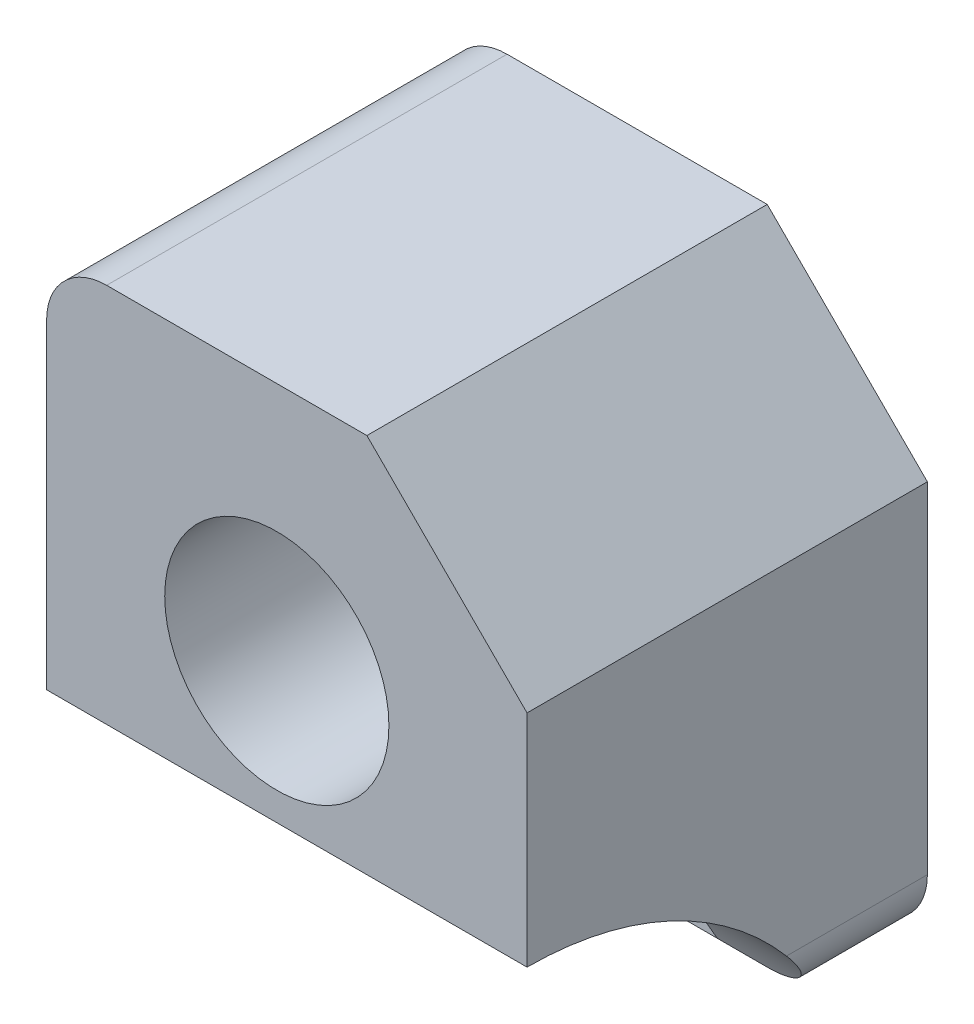
ISO-10303-21;
HEADER;
FILE_DESCRIPTION(('STEP AP214'),'2;1');
FILE_NAME('part.step','',(''),(''),'','','');
FILE_SCHEMA(('AUTOMOTIVE_DESIGN { 1 0 10303 214 1 1 1 1 }'));
ENDSEC;
DATA;
#1=APPLICATION_CONTEXT('core data for automotive mechanical design processes');
#2=APPLICATION_PROTOCOL_DEFINITION('international standard','automotive_design',2000,#1);
#3=PRODUCT_CONTEXT('',#1,'mechanical');
#4=PRODUCT('Part','Part','',(#3));
#5=PRODUCT_RELATED_PRODUCT_CATEGORY('part','',(#4));
#6=PRODUCT_DEFINITION_FORMATION('','',#4);
#7=PRODUCT_DEFINITION_CONTEXT('part definition',#1,'design');
#8=PRODUCT_DEFINITION('design','',#6,#7);
#9=PRODUCT_DEFINITION_SHAPE('','',#8);
#10=(LENGTH_UNIT() NAMED_UNIT(*) SI_UNIT(.MILLI.,.METRE.));
#11=(NAMED_UNIT(*) PLANE_ANGLE_UNIT() SI_UNIT($,.RADIAN.));
#12=(NAMED_UNIT(*) SI_UNIT($,.STERADIAN.) SOLID_ANGLE_UNIT());
#13=UNCERTAINTY_MEASURE_WITH_UNIT(LENGTH_MEASURE(1.E-05),#10,'distance_accuracy_value','');
#14=(GEOMETRIC_REPRESENTATION_CONTEXT(3) GLOBAL_UNCERTAINTY_ASSIGNED_CONTEXT((#13)) GLOBAL_UNIT_ASSIGNED_CONTEXT((#10,
#11,#12)) REPRESENTATION_CONTEXT('',''));
#15=CARTESIAN_POINT('',(0.,0.,0.));
#16=DIRECTION('',(0.,0.,1.));
#17=DIRECTION('',(1.,0.,0.));
#18=AXIS2_PLACEMENT_3D('',#15,#16,#17);
#19=CARTESIAN_POINT('',(14.,4.,20.));
#20=DIRECTION('',(0.,0.,-1.));
#21=DIRECTION('',(-1.,0.,0.));
#22=AXIS2_PLACEMENT_3D('',#19,#20,#21);
#23=CYLINDRICAL_SURFACE('',#22,2.00000000000001);
#24=CARTESIAN_POINT('',(14.,4.,0.));
#25=DIRECTION('',(0.,0.,1.));
#26=DIRECTION('',(1.,0.,0.));
#27=AXIS2_PLACEMENT_3D('',#24,#25,#26);
#28=CIRCLE('',#27,2.00000000000001);
#29=CARTESIAN_POINT('',(16.,4.,0.));
#30=VERTEX_POINT('',#29);
#31=EDGE_CURVE('E230',#30,#30,#28,.T.);
#32=ORIENTED_EDGE('',*,*,#31,.F.);
#33=EDGE_LOOP('',(#32));
#34=FACE_BOUND('',#33,.T.);
#35=CARTESIAN_POINT('',(14.,4.,5.));
#36=DIRECTION('',(0.,0.,1.));
#37=DIRECTION('',(1.,0.,0.));
#38=AXIS2_PLACEMENT_3D('',#35,#36,#37);
#39=CIRCLE('',#38,2.00000000000001);
#40=CARTESIAN_POINT('',(16.,4.,5.));
#41=VERTEX_POINT('',#40);
#42=EDGE_CURVE('E165',#41,#41,#39,.T.);
#43=ORIENTED_EDGE('',*,*,#42,.T.);
#44=EDGE_LOOP('',(#43));
#45=FACE_BOUND('',#44,.T.);
#46=ADVANCED_FACE('F52',(#34,#45),#23,.F.);
#47=CARTESIAN_POINT('',(4.,4.,20.));
#48=DIRECTION('',(0.,0.,-1.));
#49=DIRECTION('',(-1.,0.,0.));
#50=AXIS2_PLACEMENT_3D('',#47,#48,#49);
#51=CYLINDRICAL_SURFACE('',#50,2.);
#52=CARTESIAN_POINT('',(4.,4.,0.));
#53=DIRECTION('',(0.,0.,1.));
#54=DIRECTION('',(1.,0.,0.));
#55=AXIS2_PLACEMENT_3D('',#52,#53,#54);
#56=CIRCLE('',#55,2.);
#57=CARTESIAN_POINT('',(6.,4.,0.));
#58=VERTEX_POINT('',#57);
#59=EDGE_CURVE('E227',#58,#58,#56,.T.);
#60=ORIENTED_EDGE('',*,*,#59,.F.);
#61=EDGE_LOOP('',(#60));
#62=FACE_BOUND('',#61,.T.);
#63=CARTESIAN_POINT('',(4.,4.,5.));
#64=DIRECTION('',(0.,0.,1.));
#65=DIRECTION('',(1.,0.,0.));
#66=AXIS2_PLACEMENT_3D('',#63,#64,#65);
#67=CIRCLE('',#66,2.);
#68=CARTESIAN_POINT('',(6.,4.,5.));
#69=VERTEX_POINT('',#68);
#70=EDGE_CURVE('E196',#69,#69,#67,.T.);
#71=ORIENTED_EDGE('',*,*,#70,.T.);
#72=EDGE_LOOP('',(#71));
#73=FACE_BOUND('',#72,.T.);
#74=ADVANCED_FACE('F293',(#62,#73),#51,.F.);
#75=CARTESIAN_POINT('',(30.,-8.,20.));
#76=DIRECTION('',(-1.,0.,0.));
#77=DIRECTION('',(0.,0.,1.));
#78=AXIS2_PLACEMENT_3D('',#75,#76,#77);
#79=CYLINDRICAL_SURFACE('',#78,17.);
#80=DIRECTION('',(-1.,0.,0.));
#81=VECTOR('',#80,1.);
#82=CARTESIAN_POINT('',(30.,0.,5.));
#83=LINE('',#82,#81);
#84=CARTESIAN_POINT('',(21.,0.,5.));
#85=VERTEX_POINT('',#84);
#86=CARTESIAN_POINT('',(18.5,0.,5.));
#87=VERTEX_POINT('',#86);
#88=EDGE_CURVE('E203',#85,#87,#83,.T.);
#89=ORIENTED_EDGE('',*,*,#88,.F.);
#90=CARTESIAN_POINT('',(21.,0.,5.));
#91=CARTESIAN_POINT('',(21.0764088854411,-1.20717350892555E-05,4.99999811573288));
#92=CARTESIAN_POINT('',(21.1528122415604,0.00291890408008091,5.00155686392892));
#93=CARTESIAN_POINT('',(21.305033199817,0.0145751360655718,5.00777984418738));
#94=CARTESIAN_POINT('',(21.380850918302,0.0232992097306947,5.01244344247861));
#95=CARTESIAN_POINT('',(21.5311310912768,0.0464150590027096,5.02484167087533));
#96=CARTESIAN_POINT('',(21.605596937509,0.0607897001509363,5.03256701728735));
#97=CARTESIAN_POINT('',(21.752854744433,0.0950158277154609,5.05105038471105));
#98=CARTESIAN_POINT('',(21.8256466791367,0.114867399100566,5.06180845277228));
#99=CARTESIAN_POINT('',(22.040710341514,0.182301746184372,5.09857082495992));
#100=CARTESIAN_POINT('',(22.1798457162863,0.237791763147097,5.12907775409014));
#101=CARTESIAN_POINT('',(22.4459038982596,0.367262546665944,5.2015412051815));
#102=CARTESIAN_POINT('',(22.5728222857226,0.441249970465268,5.24350184985156));
#103=CARTESIAN_POINT('',(22.815731712799,0.607212634009006,5.33966742130828));
#104=CARTESIAN_POINT('',(22.9312401293523,0.699689792304387,5.39422269187068));
#105=CARTESIAN_POINT('',(23.144683707385,0.897260708028354,5.51372799762142));
#106=CARTESIAN_POINT('',(23.2426135343048,1.00235827926834,5.57868117697929));
#107=CARTESIAN_POINT('',(23.429258464551,1.23282793684815,5.72500975226815));
#108=CARTESIAN_POINT('',(23.5159793076029,1.35917302313789,5.80738818726223));
#109=CARTESIAN_POINT('',(23.6671475183482,1.61837824079589,5.98175312170164));
#110=CARTESIAN_POINT('',(23.731578597622,1.75124305589147,6.07374658375145));
#111=CARTESIAN_POINT('',(23.8475988611937,2.04119929945403,6.28100233865607));
#112=CARTESIAN_POINT('',(23.8955026691378,2.19877587214032,6.39763604585119));
#113=CARTESIAN_POINT('',(23.9646098985642,2.51317106338381,6.63914355718186));
#114=CARTESIAN_POINT('',(23.9858288038118,2.66999006884038,6.76401253853305));
#115=CARTESIAN_POINT('',(23.9983146689567,2.88355082731465,6.94035898978488));
#116=CARTESIAN_POINT('',(23.9999991241123,2.94195900161804,6.98925305938526));
#117=CARTESIAN_POINT('',(24.,3.,7.03851860318428));
#118=B_SPLINE_CURVE_WITH_KNOTS('',3,(#90,#91,#92,#93,#94,#95,#96,#97,#98,#99,#100,#101,#102,
#103,#104,#105,#106,#107,#108,#109,#110,#111,#112,#113,#114,#115,#116,#117),.UNSPECIFIED.,.F.,
.F.,(4,2,2,2,2,2,2,2,2,2,2,2,2,4),(0.,0.229145118120811,0.458243476797829,0.686652424242741,
0.915064915411317,1.37136112884847,1.82782180095093,2.29896062787174,2.77024219005592,
3.29016520838336,3.81046736592894,4.41372579560865,5.01663402621998,5.24509986542481),.UNSPECIFIED.);
#119=CARTESIAN_POINT('',(24.,3.,7.03851860318428));
#120=VERTEX_POINT('',#119);
#121=EDGE_CURVE('E60',#85,#120,#118,.T.);
#122=ORIENTED_EDGE('',*,*,#121,.T.);
#123=CARTESIAN_POINT('',(24.,-8.,20.));
#124=DIRECTION('',(-1.,0.,0.));
#125=DIRECTION('',(0.,0.,1.));
#126=AXIS2_PLACEMENT_3D('',#123,#124,#125);
#127=CIRCLE('',#126,17.);
#128=CARTESIAN_POINT('',(24.,9.,20.));
#129=VERTEX_POINT('',#128);
#130=EDGE_CURVE('E205',#129,#120,#127,.T.);
#131=ORIENTED_EDGE('',*,*,#130,.F.);
#132=DIRECTION('',(-1.,0.,0.));
#133=VECTOR('',#132,1.);
#134=CARTESIAN_POINT('',(30.,9.,20.));
#135=LINE('',#134,#133);
#136=CARTESIAN_POINT('',(0.,9.,20.));
#137=VERTEX_POINT('',#136);
#138=EDGE_CURVE('E249',#129,#137,#135,.T.);
#139=ORIENTED_EDGE('',*,*,#138,.T.);
#140=CARTESIAN_POINT('',(0.,-8.,20.));
#141=DIRECTION('',(-1.,0.,0.));
#142=DIRECTION('',(0.,0.,1.));
#143=AXIS2_PLACEMENT_3D('',#140,#141,#142);
#144=CIRCLE('',#143,17.);
#145=CARTESIAN_POINT('',(0.,6.06155281280885,10.4463236137816));
#146=VERTEX_POINT('',#145);
#147=EDGE_CURVE('E200',#137,#146,#144,.T.);
#148=ORIENTED_EDGE('',*,*,#147,.T.);
#149=CARTESIAN_POINT('',(0.,6.06155281280885,10.4463236137816));
#150=CARTESIAN_POINT('',(0.0495576649739206,6.15768125691109,10.5878060626458));
#151=CARTESIAN_POINT('',(0.102114391334273,6.25117350422128,10.7300098451449));
#152=CARTESIAN_POINT('',(0.212865824775228,6.43289213636139,11.0155556706595));
#153=CARTESIAN_POINT('',(0.271059795672405,6.52111920636005,11.1588975628075));
#154=CARTESIAN_POINT('',(0.392808866787494,6.69243783253494,11.4466181049227));
#155=CARTESIAN_POINT('',(0.45637007379429,6.77552334734409,11.5909977600859));
#156=CARTESIAN_POINT('',(0.588562309680955,6.93648457041131,11.8803427208734));
#157=CARTESIAN_POINT('',(0.657193475464848,7.01436013787696,12.0253080422125));
#158=CARTESIAN_POINT('',(0.798884011374749,7.16440014843562,12.3144739217149));
#159=CARTESIAN_POINT('',(0.871908451567413,7.23660124035958,12.4586725948106));
#160=CARTESIAN_POINT('',(1.02281525786022,7.37593242064748,12.7469777116518));
#161=CARTESIAN_POINT('',(1.10069759281922,7.44306254151237,12.8910841559824));
#162=CARTESIAN_POINT('',(1.26141572676633,7.57222318194456,13.1786591519161));
#163=CARTESIAN_POINT('',(1.34424781751823,7.6342574384805,13.3221280966491));
#164=CARTESIAN_POINT('',(1.5152789966516,7.7532682254799,13.6079356867605));
#165=CARTESIAN_POINT('',(1.60347707727965,7.81024570071446,13.7502745387328));
#166=CARTESIAN_POINT('',(1.74501163673931,7.89466979089833,13.9695401930718));
#167=CARTESIAN_POINT('',(1.79622918526569,7.92389345240162,14.0471540620925));
#168=CARTESIAN_POINT('',(1.90070785779715,7.98076651506496,14.2015620776224));
#169=CARTESIAN_POINT('',(1.95396882616314,8.00841603572414,14.2783562859946));
#170=CARTESIAN_POINT('',(2.11754724864029,8.08916521438071,14.5077323909514));
#171=CARTESIAN_POINT('',(2.23131987915113,8.13986032677673,14.6587727944357));
#172=CARTESIAN_POINT('',(2.41172254496275,8.21088686373001,14.8801113434367));
#173=CARTESIAN_POINT('',(2.47376765201981,8.23381360743637,14.9533226614076));
#174=CARTESIAN_POINT('',(2.60166171762401,8.27776007998216,15.0969247590182));
#175=CARTESIAN_POINT('',(2.66750920702344,8.29878053740091,15.1673166104608));
#176=CARTESIAN_POINT('',(2.80364504189143,8.33863453962015,15.3038252643999));
#177=CARTESIAN_POINT('',(2.87391594679102,8.35747593270061,15.3699570030888));
#178=CARTESIAN_POINT('',(3.02019428658114,8.39267996794466,15.4961890159489));
#179=CARTESIAN_POINT('',(3.09619277785561,8.40904635939768,15.5562983656353));
#180=CARTESIAN_POINT('',(3.23997433299755,8.43583388612464,15.6565541951015));
#181=CARTESIAN_POINT('',(3.30651305772318,8.44679284085669,15.698314641397));
#182=CARTESIAN_POINT('',(3.44475719099679,8.46615695450915,15.7730432755605));
#183=CARTESIAN_POINT('',(3.51645534062082,8.47456561782761,15.8060235207584));
#184=CARTESIAN_POINT('',(3.65181174771634,8.48692936737446,15.8549197405297));
#185=CARTESIAN_POINT('',(3.71469219259568,8.49140533721395,15.8728083702534));
#186=CARTESIAN_POINT('',(3.84265512732479,8.49770244108512,15.8980502427217));
#187=CARTESIAN_POINT('',(3.90773439582635,8.49952730004356,15.905418267127));
#188=CARTESIAN_POINT('',(4.03841703934404,8.50031160723747,15.9085795275067));
#189=CARTESIAN_POINT('',(4.10402143159,8.49926168677995,15.9043349188076));
#190=CARTESIAN_POINT('',(4.23346686626613,8.49440840313794,15.8848347955379));
#191=CARTESIAN_POINT('',(4.29730579896246,8.49060188189705,15.8695666520884));
#192=CARTESIAN_POINT('',(4.44415637976978,8.47883173633285,15.8228168546013));
#193=CARTESIAN_POINT('',(4.52583462857109,8.46986690084409,15.7874845386656));
#194=CARTESIAN_POINT('',(4.68268853197767,8.44862355653986,15.7052840649633));
#195=CARTESIAN_POINT('',(4.75784343504033,8.43633495050804,15.6583807948354));
#196=CARTESIAN_POINT('',(4.92025432248834,8.40585509013416,15.5444197850747));
#197=CARTESIAN_POINT('',(5.0058655252465,8.38695596746616,15.4752514137612));
#198=CARTESIAN_POINT('',(5.16998832694384,8.34606527389865,15.3296781380078));
#199=CARTESIAN_POINT('',(5.24848572092243,8.32406773029688,15.2532593523577));
#200=CARTESIAN_POINT('',(5.40027014659419,8.27733288019952,15.0953843437004));
#201=CARTESIAN_POINT('',(5.47352516407381,8.25258076773555,15.0139020508639));
#202=CARTESIAN_POINT('',(5.61543120195653,8.20072323831264,14.8478999287723));
#203=CARTESIAN_POINT('',(5.68408588263559,8.17361973261968,14.7633825986168));
#204=CARTESIAN_POINT('',(5.84754402249093,8.10458362418915,14.5539587498927));
#205=CARTESIAN_POINT('',(5.94032556091213,8.06143596543084,14.4278782021141));
#206=CARTESIAN_POINT('',(6.11977951003649,7.97072107976093,14.172958887522));
#207=CARTESIAN_POINT('',(6.20644962484322,7.92315220731197,14.0441191075873));
#208=CARTESIAN_POINT('',(6.37472617121714,7.82364250659821,13.7845611026642));
#209=CARTESIAN_POINT('',(6.45632549938857,7.77169577525271,13.6538405450246));
#210=CARTESIAN_POINT('',(6.61491101985108,7.66352850990836,13.3913659733939));
#211=CARTESIAN_POINT('',(6.69189662139773,7.6073074307012,13.259611829494));
#212=CARTESIAN_POINT('',(6.91659819698224,7.43214530932722,12.863313707642));
#213=CARTESIAN_POINT('',(7.05793006491751,7.30678238992181,12.5979364494451));
#214=CARTESIAN_POINT('',(7.32419305110221,7.03896458345784,12.0679303655702));
#215=CARTESIAN_POINT('',(7.44913671657052,6.89652293414528,11.8033011208903));
#216=CARTESIAN_POINT('',(7.68648538147722,6.58827003178546,11.2660425052635));
#217=CARTESIAN_POINT('',(7.79820351766676,6.42175974405671,10.9935080878885));
#218=CARTESIAN_POINT('',(8.000981321762,6.0696449211596,10.4527898492503));
#219=CARTESIAN_POINT('',(8.09202889259739,5.88402929681057,10.1846086604322));
#220=CARTESIAN_POINT('',(8.24951498175138,5.4951195968456,9.65646752054583));
#221=CARTESIAN_POINT('',(8.31609956757428,5.29193970674486,9.39646753812656));
#222=CARTESIAN_POINT('',(8.42091289852289,4.8678318980931,8.88565157098579));
#223=CARTESIAN_POINT('',(8.45918198729399,4.64692972977264,8.63482300551478));
#224=CARTESIAN_POINT('',(8.48690506487228,4.34983282300977,8.3170346335463));
#225=CARTESIAN_POINT('',(8.4917708003499,4.28082350732532,8.24451527492893));
#226=CARTESIAN_POINT('',(8.49831860405032,4.14142347535715,8.10059406157309));
#227=CARTESIAN_POINT('',(8.49999891691505,4.0710320190039,8.02919284447611));
#228=CARTESIAN_POINT('',(8.49999999999999,4.00000000000001,7.95840542120771));
#229=B_SPLINE_CURVE_WITH_KNOTS('',3,(#149,#150,#151,#152,#153,#154,#155,#156,#157,#158,#159,
#160,#161,#162,#163,#164,#165,#166,#167,#168,#169,#170,#171,#172,#173,#174,#175,#176,#177,#178,
#179,#180,#181,#182,#183,#184,#185,#186,#187,#188,#189,#190,#191,#192,#193,#194,#195,#196,#197,
#198,#199,#200,#201,#202,#203,#204,#205,#206,#207,#208,#209,#210,#211,#212,#213,#214,#215,#216,
#217,#218,#219,#220,#221,#222,#223,#224,#225,#226,#227,#228),.UNSPECIFIED.,.F.,.F.,(4,2,2,2,2,2,
2,2,2,2,2,2,2,2,2,2,2,2,2,2,2,2,2,2,2,2,2,2,2,2,2,2,2,2,2,2,2,2,2,4),(0.,0.534183463738145,
1.06829726077904,1.60302717411927,2.13777153204551,2.66871623739945,3.19965753952524,
3.73020594252472,4.26065501224732,4.55304054148975,4.84540384493812,5.43212733620589,
5.72803457156631,6.02382823080679,6.31852097611865,6.61276273121027,6.85022908133134,
7.0873676309592,7.28315977433267,7.478676554229,7.67483126652403,7.87121105660811,
8.13800846182934,8.40562565000821,8.73986125195806,9.07475019580597,9.41153509711945,
9.74804877176998,10.2349133587101,10.7219598836621,11.2096739819451,11.6974503946079,
12.6737573381519,13.649312378311,14.6632555597851,15.6777906120536,16.6861654857414,
17.6931008553943,17.9937245118364,18.2945137817645),.UNSPECIFIED.);
#230=CARTESIAN_POINT('',(8.49999999999999,4.,7.95840542120771));
#231=VERTEX_POINT('',#230);
#232=EDGE_CURVE('E347',#146,#231,#229,.T.);
#233=ORIENTED_EDGE('',*,*,#232,.T.);
#234=CARTESIAN_POINT('',(8.49999999999999,-8.,20.));
#235=DIRECTION('',(-1.,0.,0.));
#236=DIRECTION('',(0.,0.,1.));
#237=AXIS2_PLACEMENT_3D('',#234,#235,#236);
#238=CIRCLE('',#237,17.);
#239=CARTESIAN_POINT('',(8.49999999999999,0.,5.));
#240=VERTEX_POINT('',#239);
#241=EDGE_CURVE('E161',#240,#231,#238,.F.);
#242=ORIENTED_EDGE('',*,*,#241,.F.);
#243=CARTESIAN_POINT('',(9.5,0.,5.));
#244=VERTEX_POINT('',#243);
#245=EDGE_CURVE('E359',#244,#240,#83,.T.);
#246=ORIENTED_EDGE('',*,*,#245,.F.);
#247=CARTESIAN_POINT('',(9.50000000000001,-8.,20.));
#248=DIRECTION('',(-1.,0.,0.));
#249=DIRECTION('',(0.,-1.,0.));
#250=AXIS2_PLACEMENT_3D('',#247,#248,#249);
#251=CIRCLE('',#250,17.);
#252=CARTESIAN_POINT('',(9.5,4.,7.95840542120771));
#253=VERTEX_POINT('',#252);
#254=EDGE_CURVE('E251',#244,#253,#251,.F.);
#255=ORIENTED_EDGE('',*,*,#254,.T.);
#256=CARTESIAN_POINT('',(9.5,4.,7.95840542120771));
#257=CARTESIAN_POINT('',(9.50000395748743,4.0914044943781,8.04949132167229));
#258=CARTESIAN_POINT('',(9.50278443637128,4.18174793081795,8.14160020463122));
#259=CARTESIAN_POINT('',(9.51354425939322,4.36014679583887,8.32766663141079));
#260=CARTESIAN_POINT('',(9.52152221693664,4.44820282814512,8.42162367569323));
#261=CARTESIAN_POINT('',(9.55268635889075,4.70845168618201,8.70570470111247));
#262=CARTESIAN_POINT('',(9.58310539350724,4.87705426348768,8.89836667047146));
#263=CARTESIAN_POINT('',(9.66071062561587,5.20362882044656,9.28883961018568));
#264=CARTESIAN_POINT('',(9.70788229851281,5.36160986833163,9.48664598307452));
#265=CARTESIAN_POINT('',(9.81694196826845,5.66682146216995,9.88657773351949));
#266=CARTESIAN_POINT('',(9.87883788591081,5.81404616592655,10.0887053822212));
#267=CARTESIAN_POINT('',(10.0422768703318,6.15274010826598,10.5756229392214));
#268=CARTESIAN_POINT('',(10.1498718371989,6.33910365027113,10.8619413022325));
#269=CARTESIAN_POINT('',(10.3868255480558,6.69071882436846,11.4386404274752));
#270=CARTESIAN_POINT('',(10.5161944052909,6.85596058305805,11.7290230196787));
#271=CARTESIAN_POINT('',(10.725125031537,7.08804017742802,12.1655752813407));
#272=CARTESIAN_POINT('',(10.7972255833663,7.16275058924888,12.3112143369148));
#273=CARTESIAN_POINT('',(10.94637421519,7.3069832939709,12.6025231342558));
#274=CARTESIAN_POINT('',(11.0234218620924,7.37650603987564,12.7481928722268));
#275=CARTESIAN_POINT('',(11.1825032854109,7.5103435015509,13.039047880639));
#276=CARTESIAN_POINT('',(11.264533570196,7.57466179233645,13.1842334168163));
#277=CARTESIAN_POINT('',(11.433928743452,7.69814359271443,13.4736661730226));
#278=CARTESIAN_POINT('',(11.5212930727269,7.7573076410805,13.6179134896618));
#279=CARTESIAN_POINT('',(11.7146448878973,7.87839404118929,13.9248458401706));
#280=CARTESIAN_POINT('',(11.8215253265758,7.93953834902523,14.0872776026382));
#281=CARTESIAN_POINT('',(12.0448316631065,8.05502203209583,14.408457717902));
#282=CARTESIAN_POINT('',(12.1612717073346,8.10935101032875,14.5672001490545));
#283=CARTESIAN_POINT('',(12.345885514194,8.18549337429666,14.800326803985));
#284=CARTESIAN_POINT('',(12.4093714767174,8.21007449329534,14.8775193491295));
#285=CARTESIAN_POINT('',(12.5402232570303,8.2572171469658,15.0291673409341));
#286=CARTESIAN_POINT('',(12.6075876949894,8.27977939267672,15.1036237457641));
#287=CARTESIAN_POINT('',(12.7469223379722,8.32262625082576,15.2484155210567));
#288=CARTESIAN_POINT('',(12.8188792369324,8.34291701268087,15.3187617587281));
#289=CARTESIAN_POINT('',(12.9687167322031,8.38091634160638,15.4535228865071));
#290=CARTESIAN_POINT('',(13.0465885507,8.39862862548794,15.5179462638691));
#291=CARTESIAN_POINT('',(13.1941016051383,8.42775727176136,15.6260655479983));
#292=CARTESIAN_POINT('',(13.2624395430502,8.43972919881483,15.6713638199573));
#293=CARTESIAN_POINT('',(13.4046729696058,8.46102419614452,15.7530647084529));
#294=CARTESIAN_POINT('',(13.4785596671599,8.47035134913693,15.7894810237043));
#295=CARTESIAN_POINT('',(13.6166773372808,8.48406878122557,15.8435466627931));
#296=CARTESIAN_POINT('',(13.6799311524168,8.48907041147643,15.863482478682));
#297=CARTESIAN_POINT('',(13.8089781146089,8.49640599885808,15.8928322984602));
#298=CARTESIAN_POINT('',(13.8747671995161,8.49874405386169,15.9022624646475));
#299=CARTESIAN_POINT('',(14.0073549707445,8.50048396050065,15.9092730577385));
#300=CARTESIAN_POINT('',(14.0741569643444,8.49987184283835,15.906797108382));
#301=CARTESIAN_POINT('',(14.2062203958256,8.49575979538804,15.890258738635));
#302=CARTESIAN_POINT('',(14.2714801066021,8.49225677252071,15.8761839082241));
#303=CARTESIAN_POINT('',(14.4177913135748,8.48133054083102,15.8327023930196));
#304=CARTESIAN_POINT('',(14.497769253972,8.47305145750561,15.7999814858164));
#305=CARTESIAN_POINT('',(14.6515795378446,8.45325783552328,15.7230994785655));
#306=CARTESIAN_POINT('',(14.7253934228522,8.44173400121762,15.6789055390671));
#307=CARTESIAN_POINT('',(14.8821498999958,8.41354873566514,15.5729232290321));
#308=CARTESIAN_POINT('',(14.9637829499255,8.39631702119702,15.5093877860398));
#309=CARTESIAN_POINT('',(15.1204837149191,8.35901463834684,15.3753366849474));
#310=CARTESIAN_POINT('',(15.1955388928886,8.33893873169459,15.3048082210926));
#311=CARTESIAN_POINT('',(15.3407744029065,8.29628650985611,15.158836412858));
#312=CARTESIAN_POINT('',(15.4109248104231,8.27369671391476,15.083367561136));
#313=CARTESIAN_POINT('',(15.5468840112846,8.22638369848768,14.9294019320264));
#314=CARTESIAN_POINT('',(15.6126961030444,8.20166213357681,14.8509075286325));
#315=CARTESIAN_POINT('',(15.7716092214206,8.13785763107547,14.6535190431871));
#316=CARTESIAN_POINT('',(15.8626265891695,8.09758210946055,14.5333369700502));
#317=CARTESIAN_POINT('',(16.0386639222831,8.01290075716924,14.2900405482304));
#318=CARTESIAN_POINT('',(16.1236814332532,7.96849325322531,14.166925026778));
#319=CARTESIAN_POINT('',(16.2888027146167,7.87561177279548,13.9186729687858));
#320=CARTESIAN_POINT('',(16.3688992404388,7.8271320384045,13.7935337797022));
#321=CARTESIAN_POINT('',(16.5246639843038,7.72621417175508,13.5420932413085));
#322=CARTESIAN_POINT('',(16.6003316167907,7.67377551816627,13.4157917408692));
#323=CARTESIAN_POINT('',(16.8214258279169,7.51044543156766,13.0356530003998));
#324=CARTESIAN_POINT('',(16.960800768262,7.39362125441372,12.7808007169415));
#325=CARTESIAN_POINT('',(17.2243785507563,7.14423442726891,12.2713107945576));
#326=CARTESIAN_POINT('',(17.3485935073991,7.01168451315524,12.0166731478797));
#327=CARTESIAN_POINT('',(17.5876510079521,6.72317416813715,11.4958040227481));
#328=CARTESIAN_POINT('',(17.7016599519492,6.56635037299425,11.2296651599127));
#329=CARTESIAN_POINT('',(17.9108486053268,6.2346613390059,10.7009761246614));
#330=CARTESIAN_POINT('',(18.0060184144837,6.05978668723912,10.4384279062847));
#331=CARTESIAN_POINT('',(18.1741829876603,5.69311968600992,9.9203860058721));
#332=CARTESIAN_POINT('',(18.2472997352338,5.50142826457879,9.66486089874401));
#333=CARTESIAN_POINT('',(18.3682677475141,5.10087784416679,9.16163419247375));
#334=CARTESIAN_POINT('',(18.4161475882968,4.89203857308064,8.91392404457169));
#335=CARTESIAN_POINT('',(18.4655378014299,4.56660518108971,8.54980075912049));
#336=CARTESIAN_POINT('',(18.4782647178343,4.45595648186604,8.42952511075732));
#337=CARTESIAN_POINT('',(18.4954961993189,4.23078580948268,8.19175047629548));
#338=CARTESIAN_POINT('',(18.49998969487,4.11625883237395,8.07425543767465));
#339=CARTESIAN_POINT('',(18.5,4.00000000000001,7.95840542120771));
#340=B_SPLINE_CURVE_WITH_KNOTS('',3,(#256,#257,#258,#259,#260,#261,#262,#263,#264,#265,#266,
#267,#268,#269,#270,#271,#272,#273,#274,#275,#276,#277,#278,#279,#280,#281,#282,#283,#284,#285,
#286,#287,#288,#289,#290,#291,#292,#293,#294,#295,#296,#297,#298,#299,#300,#301,#302,#303,#304,
#305,#306,#307,#308,#309,#310,#311,#312,#313,#314,#315,#316,#317,#318,#319,#320,#321,#322,#323,
#324,#325,#326,#327,#328,#329,#330,#331,#332,#333,#334,#335,#336,#337,#338,#339),.UNSPECIFIED.,
.F.,.F.,(4,2,2,2,2,2,2,2,2,2,2,2,2,2,2,2,2,2,2,2,2,2,2,2,2,2,2,2,2,2,2,2,2,2,2,2,2,2,2,2,2,4),
(0.,0.387032748470064,0.773962285759765,1.54643256241779,2.31823473316158,3.09045303102278,
4.16348813096331,5.23702300224475,5.77348634923154,6.30990279556861,6.84594758523306,
7.38193627466361,7.99314134345302,8.60526776995012,8.91394559425845,9.22251427200547,
9.53022628057543,9.83749024208736,10.0855769742731,10.3332786257619,10.5320323216932,
10.7304798231721,10.929867909676,11.1294696053839,11.3884157008732,11.6481113147416,
11.9620016742115,12.2764778415883,12.5927300136787,12.9087388983729,13.3766012997366,
13.8446539958794,14.3133800067392,14.7821678498207,15.7205636951521,16.658204679695,
17.6450375397983,18.6323876253434,19.6141716947542,20.5948416761479,21.0863721296846,
21.5785629441533),.UNSPECIFIED.);
#341=CARTESIAN_POINT('',(18.5,4.,7.95840542120771));
#342=VERTEX_POINT('',#341);
#343=EDGE_CURVE('E254',#253,#342,#340,.T.);
#344=ORIENTED_EDGE('',*,*,#343,.T.);
#345=CARTESIAN_POINT('',(18.5,-8.,20.));
#346=DIRECTION('',(-1.,0.,0.));
#347=DIRECTION('',(0.,0.,1.));
#348=AXIS2_PLACEMENT_3D('',#345,#346,#347);
#349=CIRCLE('',#348,17.);
#350=EDGE_CURVE('E263',#87,#342,#349,.F.);
#351=ORIENTED_EDGE('',*,*,#350,.F.);
#352=EDGE_LOOP('',(#89,#122,#131,#139,#148,#233,#242,#246,#255,#344,#351));
#353=FACE_BOUND('',#352,.T.);
#354=ADVANCED_FACE('F265',(#353),#79,.F.);
#355=CARTESIAN_POINT('',(0.,0.,20.));
#356=DIRECTION('',(0.,1.,0.));
#357=DIRECTION('',(0.,0.,1.));
#358=AXIS2_PLACEMENT_3D('',#355,#356,#357);
#359=PLANE('',#358);
#360=DIRECTION('',(1.,0.,0.));
#361=VECTOR('',#360,1.);
#362=CARTESIAN_POINT('',(0.,0.,0.));
#363=LINE('',#362,#361);
#364=CARTESIAN_POINT('',(3.,0.,0.));
#365=VERTEX_POINT('',#364);
#366=CARTESIAN_POINT('',(21.,0.,0.));
#367=VERTEX_POINT('',#366);
#368=EDGE_CURVE('E233',#365,#367,#363,.T.);
#369=ORIENTED_EDGE('',*,*,#368,.T.);
#370=DIRECTION('',(0.,0.,-1.));
#371=VECTOR('',#370,1.);
#372=CARTESIAN_POINT('',(21.,0.,20.));
#373=LINE('',#372,#371);
#374=EDGE_CURVE('E73',#367,#85,#373,.F.);
#375=ORIENTED_EDGE('',*,*,#374,.T.);
#376=ORIENTED_EDGE('',*,*,#88,.T.);
#377=EDGE_CURVE('E206',#87,#244,#83,.T.);
#378=ORIENTED_EDGE('',*,*,#377,.T.);
#379=ORIENTED_EDGE('',*,*,#245,.T.);
#380=CARTESIAN_POINT('',(3.,0.,5.));
#381=VERTEX_POINT('',#380);
#382=EDGE_CURVE('E170',#240,#381,#83,.T.);
#383=ORIENTED_EDGE('',*,*,#382,.T.);
#384=DIRECTION('',(0.,0.,-1.));
#385=VECTOR('',#384,1.);
#386=CARTESIAN_POINT('',(3.,0.,0.));
#387=LINE('',#386,#385);
#388=EDGE_CURVE('E326',#381,#365,#387,.T.);
#389=ORIENTED_EDGE('',*,*,#388,.T.);
#390=EDGE_LOOP('',(#369,#375,#376,#378,#379,#383,#389));
#391=FACE_BOUND('',#390,.T.);
#392=ADVANCED_FACE('F304',(#391),#359,.F.);
#393=CARTESIAN_POINT('',(24.,0.,20.));
#394=DIRECTION('',(-1.,0.,0.));
#395=DIRECTION('',(0.,0.,1.));
#396=AXIS2_PLACEMENT_3D('',#393,#394,#395);
#397=PLANE('',#396);
#398=ORIENTED_EDGE('',*,*,#130,.T.);
#399=DIRECTION('',(0.,0.,-1.));
#400=VECTOR('',#399,1.);
#401=CARTESIAN_POINT('',(24.,3.,20.));
#402=LINE('',#401,#400);
#403=CARTESIAN_POINT('',(24.,3.,0.));
#404=VERTEX_POINT('',#403);
#405=EDGE_CURVE('E329',#120,#404,#402,.T.);
#406=ORIENTED_EDGE('',*,*,#405,.T.);
#407=DIRECTION('',(0.,1.,0.));
#408=VECTOR('',#407,1.);
#409=CARTESIAN_POINT('',(24.,0.,0.));
#410=LINE('',#409,#408);
#411=CARTESIAN_POINT('',(24.,20.,0.));
#412=VERTEX_POINT('',#411);
#413=EDGE_CURVE('E235',#404,#412,#410,.T.);
#414=ORIENTED_EDGE('',*,*,#413,.T.);
#415=DIRECTION('',(0.,0.,-1.));
#416=VECTOR('',#415,1.);
#417=CARTESIAN_POINT('',(24.,20.,20.));
#418=LINE('',#417,#416);
#419=CARTESIAN_POINT('',(24.,20.,20.));
#420=VERTEX_POINT('',#419);
#421=EDGE_CURVE('E246',#420,#412,#418,.T.);
#422=ORIENTED_EDGE('',*,*,#421,.F.);
#423=DIRECTION('',(0.,1.,0.));
#424=VECTOR('',#423,1.);
#425=CARTESIAN_POINT('',(24.,0.,20.));
#426=LINE('',#425,#424);
#427=EDGE_CURVE('E213',#129,#420,#426,.T.);
#428=ORIENTED_EDGE('',*,*,#427,.F.);
#429=EDGE_LOOP('',(#398,#406,#414,#422,#428));
#430=FACE_BOUND('',#429,.T.);
#431=ADVANCED_FACE('F386',(#430),#397,.F.);
#432=CARTESIAN_POINT('',(22.,22.,20.));
#433=DIRECTION('',(0.707106781186549,0.707106781186546,0.));
#434=DIRECTION('',(-0.707106781186546,0.707106781186549,0.));
#435=AXIS2_PLACEMENT_3D('',#432,#433,#434);
#436=PLANE('',#435);
#437=DIRECTION('',(0.707106781186546,-0.707106781186549,0.));
#438=VECTOR('',#437,1.);
#439=CARTESIAN_POINT('',(22.,22.,0.));
#440=LINE('',#439,#438);
#441=CARTESIAN_POINT('',(16.,28.,0.));
#442=VERTEX_POINT('',#441);
#443=EDGE_CURVE('E237',#442,#412,#440,.T.);
#444=ORIENTED_EDGE('',*,*,#443,.F.);
#445=DIRECTION('',(0.,0.,-1.));
#446=VECTOR('',#445,1.);
#447=CARTESIAN_POINT('',(16.,28.,20.));
#448=LINE('',#447,#446);
#449=CARTESIAN_POINT('',(16.,28.,20.));
#450=VERTEX_POINT('',#449);
#451=EDGE_CURVE('E224',#450,#442,#448,.T.);
#452=ORIENTED_EDGE('',*,*,#451,.F.);
#453=DIRECTION('',(0.707106781186546,-0.707106781186549,0.));
#454=VECTOR('',#453,1.);
#455=CARTESIAN_POINT('',(22.,22.,20.));
#456=LINE('',#455,#454);
#457=EDGE_CURVE('E216',#450,#420,#456,.T.);
#458=ORIENTED_EDGE('',*,*,#457,.T.);
#459=ORIENTED_EDGE('',*,*,#421,.T.);
#460=EDGE_LOOP('',(#444,#452,#458,#459));
#461=FACE_BOUND('',#460,.T.);
#462=ADVANCED_FACE('F382',(#461),#436,.T.);
#463=CARTESIAN_POINT('',(0.,28.,20.));
#464=DIRECTION('',(0.,1.,0.));
#465=DIRECTION('',(0.,0.,1.));
#466=AXIS2_PLACEMENT_3D('',#463,#464,#465);
#467=PLANE('',#466);
#468=DIRECTION('',(1.,0.,0.));
#469=VECTOR('',#468,1.);
#470=CARTESIAN_POINT('',(0.,28.,0.));
#471=LINE('',#470,#469);
#472=CARTESIAN_POINT('',(3.,28.,0.));
#473=VERTEX_POINT('',#472);
#474=EDGE_CURVE('E240',#473,#442,#471,.T.);
#475=ORIENTED_EDGE('',*,*,#474,.F.);
#476=DIRECTION('',(0.,0.,-1.));
#477=VECTOR('',#476,1.);
#478=CARTESIAN_POINT('',(3.,28.,20.));
#479=LINE('',#478,#477);
#480=CARTESIAN_POINT('',(3.,28.,20.));
#481=VERTEX_POINT('',#480);
#482=EDGE_CURVE('E334',#473,#481,#479,.F.);
#483=ORIENTED_EDGE('',*,*,#482,.T.);
#484=DIRECTION('',(1.,0.,0.));
#485=VECTOR('',#484,1.);
#486=CARTESIAN_POINT('',(0.,28.,20.));
#487=LINE('',#486,#485);
#488=EDGE_CURVE('E219',#481,#450,#487,.T.);
#489=ORIENTED_EDGE('',*,*,#488,.T.);
#490=ORIENTED_EDGE('',*,*,#451,.T.);
#491=EDGE_LOOP('',(#475,#483,#489,#490));
#492=FACE_BOUND('',#491,.T.);
#493=ADVANCED_FACE('F311',(#492),#467,.T.);
#494=CARTESIAN_POINT('',(11.5,16.,20.));
#495=DIRECTION('',(0.,0.,-1.));
#496=DIRECTION('',(-1.,0.,0.));
#497=AXIS2_PLACEMENT_3D('',#494,#495,#496);
#498=CYLINDRICAL_SURFACE('',#497,5.6);
#499=CARTESIAN_POINT('',(11.5,16.,20.));
#500=DIRECTION('',(0.,0.,1.));
#501=DIRECTION('',(1.,0.,0.));
#502=AXIS2_PLACEMENT_3D('',#499,#500,#501);
#503=CIRCLE('',#502,5.6);
#504=CARTESIAN_POINT('',(17.1,16.,20.));
#505=VERTEX_POINT('',#504);
#506=EDGE_CURVE('E210',#505,#505,#503,.T.);
#507=ORIENTED_EDGE('',*,*,#506,.T.);
#508=EDGE_LOOP('',(#507));
#509=FACE_BOUND('',#508,.T.);
#510=CARTESIAN_POINT('',(11.5,16.,0.));
#511=DIRECTION('',(0.,0.,1.));
#512=DIRECTION('',(1.,0.,0.));
#513=AXIS2_PLACEMENT_3D('',#510,#511,#512);
#514=CIRCLE('',#513,5.6);
#515=CARTESIAN_POINT('',(17.1,16.,0.));
#516=VERTEX_POINT('',#515);
#517=EDGE_CURVE('E209',#516,#516,#514,.T.);
#518=ORIENTED_EDGE('',*,*,#517,.F.);
#519=EDGE_LOOP('',(#518));
#520=FACE_BOUND('',#519,.T.);
#521=ADVANCED_FACE('F307',(#509,#520),#498,.F.);
#522=CARTESIAN_POINT('',(0.,0.,20.));
#523=DIRECTION('',(-1.,0.,0.));
#524=DIRECTION('',(0.,0.,1.));
#525=AXIS2_PLACEMENT_3D('',#522,#523,#524);
#526=PLANE('',#525);
#527=DIRECTION('',(0.,1.,0.));
#528=VECTOR('',#527,1.);
#529=CARTESIAN_POINT('',(0.,0.,20.));
#530=LINE('',#529,#528);
#531=CARTESIAN_POINT('',(0.,25.,20.));
#532=VERTEX_POINT('',#531);
#533=EDGE_CURVE('E221',#137,#532,#530,.T.);
#534=ORIENTED_EDGE('',*,*,#533,.T.);
#535=DIRECTION('',(0.,0.,-1.));
#536=VECTOR('',#535,1.);
#537=CARTESIAN_POINT('',(0.,25.,20.));
#538=LINE('',#537,#536);
#539=CARTESIAN_POINT('',(0.,25.,0.));
#540=VERTEX_POINT('',#539);
#541=EDGE_CURVE('E342',#532,#540,#538,.T.);
#542=ORIENTED_EDGE('',*,*,#541,.T.);
#543=DIRECTION('',(0.,1.,0.));
#544=VECTOR('',#543,1.);
#545=CARTESIAN_POINT('',(0.,0.,0.));
#546=LINE('',#545,#544);
#547=CARTESIAN_POINT('',(0.,3.,0.));
#548=VERTEX_POINT('',#547);
#549=EDGE_CURVE('E214',#548,#540,#546,.T.);
#550=ORIENTED_EDGE('',*,*,#549,.F.);
#551=DIRECTION('',(0.,0.,-1.));
#552=VECTOR('',#551,1.);
#553=CARTESIAN_POINT('',(0.,3.,5.));
#554=LINE('',#553,#552);
#555=CARTESIAN_POINT('',(0.,3.,5.));
#556=VERTEX_POINT('',#555);
#557=EDGE_CURVE('E345',#548,#556,#554,.F.);
#558=ORIENTED_EDGE('',*,*,#557,.T.);
#559=DIRECTION('',(0.,-1.,0.));
#560=VECTOR('',#559,1.);
#561=CARTESIAN_POINT('',(0.,0.,5.));
#562=LINE('',#561,#560);
#563=CARTESIAN_POINT('',(0.,6.06155281280885,5.));
#564=VERTEX_POINT('',#563);
#565=EDGE_CURVE('E171',#564,#556,#562,.T.);
#566=ORIENTED_EDGE('',*,*,#565,.F.);
#567=DIRECTION('',(0.,0.,1.));
#568=VECTOR('',#567,1.);
#569=CARTESIAN_POINT('',(0.,6.06155281280885,5.));
#570=LINE('',#569,#568);
#571=EDGE_CURVE('E176',#146,#564,#570,.F.);
#572=ORIENTED_EDGE('',*,*,#571,.F.);
#573=ORIENTED_EDGE('',*,*,#147,.F.);
#574=EDGE_LOOP('',(#534,#542,#550,#558,#566,#572,#573));
#575=FACE_BOUND('',#574,.T.);
#576=ADVANCED_FACE('F310',(#575),#526,.T.);
#577=CARTESIAN_POINT('',(0.,0.,20.));
#578=DIRECTION('',(0.,0.,1.));
#579=DIRECTION('',(1.,0.,0.));
#580=AXIS2_PLACEMENT_3D('',#577,#578,#579);
#581=PLANE('',#580);
#582=ORIENTED_EDGE('',*,*,#488,.F.);
#583=CARTESIAN_POINT('',(3.,25.,20.));
#584=DIRECTION('',(0.,0.,1.));
#585=DIRECTION('',(1.,0.,0.));
#586=AXIS2_PLACEMENT_3D('',#583,#584,#585);
#587=CIRCLE('',#586,3.);
#588=EDGE_CURVE('E332',#481,#532,#587,.T.);
#589=ORIENTED_EDGE('',*,*,#588,.T.);
#590=ORIENTED_EDGE('',*,*,#533,.F.);
#591=ORIENTED_EDGE('',*,*,#138,.F.);
#592=ORIENTED_EDGE('',*,*,#427,.T.);
#593=ORIENTED_EDGE('',*,*,#457,.F.);
#594=EDGE_LOOP('',(#582,#589,#590,#591,#592,#593));
#595=FACE_BOUND('',#594,.T.);
#596=ORIENTED_EDGE('',*,*,#506,.F.);
#597=EDGE_LOOP('',(#596));
#598=FACE_BOUND('',#597,.T.);
#599=ADVANCED_FACE('F392',(#595,#598),#581,.T.);
#600=CARTESIAN_POINT('',(0.,0.,0.));
#601=DIRECTION('',(0.,0.,1.));
#602=DIRECTION('',(1.,0.,0.));
#603=AXIS2_PLACEMENT_3D('',#600,#601,#602);
#604=PLANE('',#603);
#605=ORIENTED_EDGE('',*,*,#517,.T.);
#606=EDGE_LOOP('',(#605));
#607=FACE_BOUND('',#606,.T.);
#608=ORIENTED_EDGE('',*,*,#59,.T.);
#609=EDGE_LOOP('',(#608));
#610=FACE_BOUND('',#609,.T.);
#611=ORIENTED_EDGE('',*,*,#31,.T.);
#612=EDGE_LOOP('',(#611));
#613=FACE_BOUND('',#612,.T.);
#614=ORIENTED_EDGE('',*,*,#549,.T.);
#615=CARTESIAN_POINT('',(3.,25.,0.));
#616=DIRECTION('',(0.,0.,1.));
#617=DIRECTION('',(1.,0.,0.));
#618=AXIS2_PLACEMENT_3D('',#615,#616,#617);
#619=CIRCLE('',#618,3.);
#620=EDGE_CURVE('E336',#540,#473,#619,.F.);
#621=ORIENTED_EDGE('',*,*,#620,.T.);
#622=ORIENTED_EDGE('',*,*,#474,.T.);
#623=ORIENTED_EDGE('',*,*,#443,.T.);
#624=ORIENTED_EDGE('',*,*,#413,.F.);
#625=CARTESIAN_POINT('',(21.,3.,0.));
#626=DIRECTION('',(0.,0.,1.));
#627=DIRECTION('',(1.,0.,0.));
#628=AXIS2_PLACEMENT_3D('',#625,#626,#627);
#629=CIRCLE('',#628,3.);
#630=EDGE_CURVE('E338',#404,#367,#629,.F.);
#631=ORIENTED_EDGE('',*,*,#630,.T.);
#632=ORIENTED_EDGE('',*,*,#368,.F.);
#633=CARTESIAN_POINT('',(3.,3.,0.));
#634=DIRECTION('',(0.,0.,1.));
#635=DIRECTION('',(1.,0.,0.));
#636=AXIS2_PLACEMENT_3D('',#633,#634,#635);
#637=CIRCLE('',#636,3.);
#638=EDGE_CURVE('E340',#365,#548,#637,.F.);
#639=ORIENTED_EDGE('',*,*,#638,.T.);
#640=EDGE_LOOP('',(#614,#621,#622,#623,#624,#631,#632,#639));
#641=FACE_BOUND('',#640,.T.);
#642=ADVANCED_FACE('F275',(#607,#610,#613,#641),#604,.F.);
#643=CARTESIAN_POINT('',(14.,4.,5.));
#644=DIRECTION('',(0.,0.,1.));
#645=DIRECTION('',(1.,0.,0.));
#646=AXIS2_PLACEMENT_3D('',#643,#644,#645);
#647=CYLINDRICAL_SURFACE('',#646,4.5);
#648=DIRECTION('',(0.,0.,1.));
#649=VECTOR('',#648,1.);
#650=CARTESIAN_POINT('',(9.5,4.,5.));
#651=LINE('',#650,#649);
#652=CARTESIAN_POINT('',(9.5,4.,5.));
#653=VERTEX_POINT('',#652);
#654=EDGE_CURVE('E184',#653,#253,#651,.T.);
#655=ORIENTED_EDGE('',*,*,#654,.F.);
#656=CARTESIAN_POINT('',(14.,4.,5.));
#657=DIRECTION('',(0.,0.,1.));
#658=DIRECTION('',(1.,0.,0.));
#659=AXIS2_PLACEMENT_3D('',#656,#657,#658);
#660=CIRCLE('',#659,4.5);
#661=CARTESIAN_POINT('',(18.5,4.,5.));
#662=VERTEX_POINT('',#661);
#663=EDGE_CURVE('E177',#662,#653,#660,.T.);
#664=ORIENTED_EDGE('',*,*,#663,.F.);
#665=DIRECTION('',(0.,0.,1.));
#666=VECTOR('',#665,1.);
#667=CARTESIAN_POINT('',(18.5,4.,5.));
#668=LINE('',#667,#666);
#669=EDGE_CURVE('E187',#662,#342,#668,.T.);
#670=ORIENTED_EDGE('',*,*,#669,.T.);
#671=ORIENTED_EDGE('',*,*,#343,.F.);
#672=EDGE_LOOP('',(#655,#664,#670,#671));
#673=FACE_BOUND('',#672,.T.);
#674=ADVANCED_FACE('F269',(#673),#647,.F.);
#675=CARTESIAN_POINT('',(0.,0.,5.));
#676=DIRECTION('',(0.,0.,1.));
#677=DIRECTION('',(1.,0.,0.));
#678=AXIS2_PLACEMENT_3D('',#675,#676,#677);
#679=PLANE('',#678);
#680=ORIENTED_EDGE('',*,*,#42,.F.);
#681=EDGE_LOOP('',(#680));
#682=FACE_BOUND('',#681,.T.);
#683=ORIENTED_EDGE('',*,*,#377,.F.);
#684=DIRECTION('',(0.,-1.,0.));
#685=VECTOR('',#684,1.);
#686=CARTESIAN_POINT('',(18.5,0.,5.));
#687=LINE('',#686,#685);
#688=EDGE_CURVE('E186',#662,#87,#687,.T.);
#689=ORIENTED_EDGE('',*,*,#688,.F.);
#690=ORIENTED_EDGE('',*,*,#663,.T.);
#691=DIRECTION('',(0.,-1.,0.));
#692=VECTOR('',#691,1.);
#693=CARTESIAN_POINT('',(9.5,0.,5.));
#694=LINE('',#693,#692);
#695=EDGE_CURVE('E181',#653,#244,#694,.T.);
#696=ORIENTED_EDGE('',*,*,#695,.T.);
#697=EDGE_LOOP('',(#683,#689,#690,#696));
#698=FACE_BOUND('',#697,.T.);
#699=ADVANCED_FACE('F274',(#682,#698),#679,.T.);
#700=CARTESIAN_POINT('',(18.5,0.,5.));
#701=DIRECTION('',(-1.,0.,0.));
#702=DIRECTION('',(0.,0.,1.));
#703=AXIS2_PLACEMENT_3D('',#700,#701,#702);
#704=PLANE('',#703);
#705=ORIENTED_EDGE('',*,*,#350,.T.);
#706=ORIENTED_EDGE('',*,*,#669,.F.);
#707=ORIENTED_EDGE('',*,*,#688,.T.);
#708=EDGE_LOOP('',(#705,#706,#707));
#709=FACE_BOUND('',#708,.T.);
#710=ADVANCED_FACE('F282',(#709),#704,.T.);
#711=CARTESIAN_POINT('',(9.5,0.,5.));
#712=DIRECTION('',(-1.,0.,0.));
#713=DIRECTION('',(0.,-1.,0.));
#714=AXIS2_PLACEMENT_3D('',#711,#712,#713);
#715=PLANE('',#714);
#716=ORIENTED_EDGE('',*,*,#695,.F.);
#717=ORIENTED_EDGE('',*,*,#654,.T.);
#718=ORIENTED_EDGE('',*,*,#254,.F.);
#719=EDGE_LOOP('',(#716,#717,#718));
#720=FACE_BOUND('',#719,.T.);
#721=ADVANCED_FACE('F279',(#720),#715,.F.);
#722=CARTESIAN_POINT('',(8.49999999999999,0.,5.));
#723=DIRECTION('',(-1.,0.,0.));
#724=DIRECTION('',(0.,0.,1.));
#725=AXIS2_PLACEMENT_3D('',#722,#723,#724);
#726=PLANE('',#725);
#727=ORIENTED_EDGE('',*,*,#241,.T.);
#728=DIRECTION('',(0.,0.,1.));
#729=VECTOR('',#728,1.);
#730=CARTESIAN_POINT('',(8.49999999999999,4.,5.));
#731=LINE('',#730,#729);
#732=CARTESIAN_POINT('',(8.49999999999999,4.,5.));
#733=VERTEX_POINT('',#732);
#734=EDGE_CURVE('E156',#733,#231,#731,.T.);
#735=ORIENTED_EDGE('',*,*,#734,.F.);
#736=DIRECTION('',(0.,-1.,0.));
#737=VECTOR('',#736,1.);
#738=CARTESIAN_POINT('',(8.49999999999999,0.,5.));
#739=LINE('',#738,#737);
#740=EDGE_CURVE('E159',#733,#240,#739,.T.);
#741=ORIENTED_EDGE('',*,*,#740,.T.);
#742=EDGE_LOOP('',(#727,#735,#741));
#743=FACE_BOUND('',#742,.T.);
#744=ADVANCED_FACE('F158',(#743),#726,.T.);
#745=CARTESIAN_POINT('',(0.,0.,5.));
#746=DIRECTION('',(0.,0.,1.));
#747=DIRECTION('',(1.,0.,0.));
#748=AXIS2_PLACEMENT_3D('',#745,#746,#747);
#749=PLANE('',#748);
#750=ORIENTED_EDGE('',*,*,#70,.F.);
#751=EDGE_LOOP('',(#750));
#752=FACE_BOUND('',#751,.T.);
#753=ORIENTED_EDGE('',*,*,#565,.T.);
#754=CARTESIAN_POINT('',(3.,3.,5.));
#755=DIRECTION('',(0.,0.,1.));
#756=DIRECTION('',(1.,0.,0.));
#757=AXIS2_PLACEMENT_3D('',#754,#755,#756);
#758=CIRCLE('',#757,3.);
#759=EDGE_CURVE('E12',#556,#381,#758,.T.);
#760=ORIENTED_EDGE('',*,*,#759,.T.);
#761=ORIENTED_EDGE('',*,*,#382,.F.);
#762=ORIENTED_EDGE('',*,*,#740,.F.);
#763=CARTESIAN_POINT('',(3.99999999999999,4.,5.));
#764=DIRECTION('',(0.,0.,1.));
#765=DIRECTION('',(1.,0.,0.));
#766=AXIS2_PLACEMENT_3D('',#763,#764,#765);
#767=CIRCLE('',#766,4.5);
#768=EDGE_CURVE('E169',#733,#564,#767,.T.);
#769=ORIENTED_EDGE('',*,*,#768,.T.);
#770=EDGE_LOOP('',(#753,#760,#761,#762,#769));
#771=FACE_BOUND('',#770,.T.);
#772=ADVANCED_FACE('F168',(#752,#771),#749,.T.);
#773=CARTESIAN_POINT('',(3.99999999999999,4.,5.));
#774=DIRECTION('',(0.,0.,1.));
#775=DIRECTION('',(1.,0.,0.));
#776=AXIS2_PLACEMENT_3D('',#773,#774,#775);
#777=CYLINDRICAL_SURFACE('',#776,4.5);
#778=ORIENTED_EDGE('',*,*,#571,.T.);
#779=ORIENTED_EDGE('',*,*,#768,.F.);
#780=ORIENTED_EDGE('',*,*,#734,.T.);
#781=ORIENTED_EDGE('',*,*,#232,.F.);
#782=EDGE_LOOP('',(#778,#779,#780,#781));
#783=FACE_BOUND('',#782,.T.);
#784=ADVANCED_FACE('F174',(#783),#777,.F.);
#785=CARTESIAN_POINT('',(3.,25.,20.));
#786=DIRECTION('',(0.,0.,-1.));
#787=DIRECTION('',(-1.,0.,0.));
#788=AXIS2_PLACEMENT_3D('',#785,#786,#787);
#789=CYLINDRICAL_SURFACE('',#788,3.);
#790=ORIENTED_EDGE('',*,*,#588,.F.);
#791=ORIENTED_EDGE('',*,*,#482,.F.);
#792=ORIENTED_EDGE('',*,*,#620,.F.);
#793=ORIENTED_EDGE('',*,*,#541,.F.);
#794=EDGE_LOOP('',(#790,#791,#792,#793));
#795=FACE_BOUND('',#794,.T.);
#796=ADVANCED_FACE('F313',(#795),#789,.T.);
#797=CARTESIAN_POINT('',(21.,3.,20.));
#798=DIRECTION('',(0.,0.,-1.));
#799=DIRECTION('',(-1.,0.,0.));
#800=AXIS2_PLACEMENT_3D('',#797,#798,#799);
#801=CYLINDRICAL_SURFACE('',#800,3.);
#802=ORIENTED_EDGE('',*,*,#121,.F.);
#803=ORIENTED_EDGE('',*,*,#374,.F.);
#804=ORIENTED_EDGE('',*,*,#630,.F.);
#805=ORIENTED_EDGE('',*,*,#405,.F.);
#806=EDGE_LOOP('',(#802,#803,#804,#805));
#807=FACE_BOUND('',#806,.T.);
#808=ADVANCED_FACE('F315',(#807),#801,.T.);
#809=CARTESIAN_POINT('',(3.,3.,20.));
#810=DIRECTION('',(0.,0.,1.));
#811=DIRECTION('',(1.,0.,0.));
#812=AXIS2_PLACEMENT_3D('',#809,#810,#811);
#813=CYLINDRICAL_SURFACE('',#812,3.);
#814=ORIENTED_EDGE('',*,*,#759,.F.);
#815=ORIENTED_EDGE('',*,*,#557,.F.);
#816=ORIENTED_EDGE('',*,*,#638,.F.);
#817=ORIENTED_EDGE('',*,*,#388,.F.);
#818=EDGE_LOOP('',(#814,#815,#816,#817));
#819=FACE_BOUND('',#818,.T.);
#820=ADVANCED_FACE('F54',(#819),#813,.T.);
#821=CLOSED_SHELL('',(#46,#74,#354,#392,#431,#462,#493,#521,#576,#599,#642,#674,#699,#710,#721,
#744,#772,#784,#796,#808,#820));
#822=MANIFOLD_SOLID_BREP('B2',#821);
#823=ADVANCED_BREP_SHAPE_REPRESENTATION('',(#18,#822),#14);
#824=SHAPE_DEFINITION_REPRESENTATION(#9,#823);
ENDSEC;
END-ISO-10303-21;
